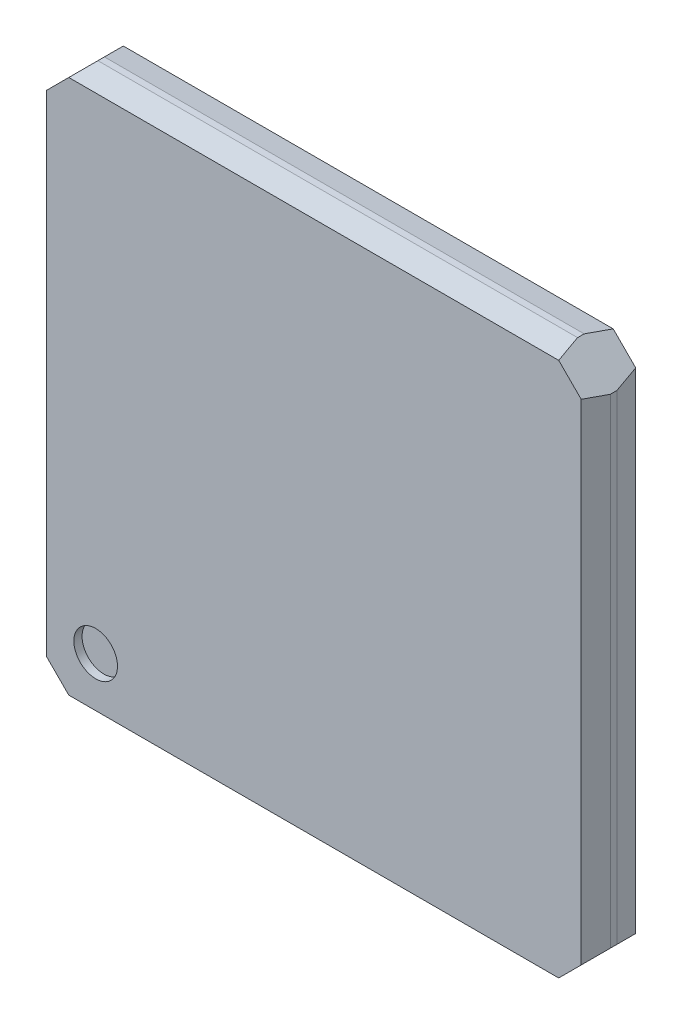
ISO-10303-21;
HEADER;
FILE_DESCRIPTION(('STEP AP214'),'2;1');
FILE_NAME('part.step','',(''),(''),'','','');
FILE_SCHEMA(('AUTOMOTIVE_DESIGN { 1 0 10303 214 1 1 1 1 }'));
ENDSEC;
DATA;
#1=APPLICATION_CONTEXT('core data for automotive mechanical design processes');
#2=APPLICATION_PROTOCOL_DEFINITION('international standard','automotive_design',2000,#1);
#3=PRODUCT_CONTEXT('',#1,'mechanical');
#4=PRODUCT('Part','Part','',(#3));
#5=PRODUCT_RELATED_PRODUCT_CATEGORY('part','',(#4));
#6=PRODUCT_DEFINITION_FORMATION('','',#4);
#7=PRODUCT_DEFINITION_CONTEXT('part definition',#1,'design');
#8=PRODUCT_DEFINITION('design','',#6,#7);
#9=PRODUCT_DEFINITION_SHAPE('','',#8);
#10=(LENGTH_UNIT() NAMED_UNIT(*) SI_UNIT(.MILLI.,.METRE.));
#11=(NAMED_UNIT(*) PLANE_ANGLE_UNIT() SI_UNIT($,.RADIAN.));
#12=(NAMED_UNIT(*) SI_UNIT($,.STERADIAN.) SOLID_ANGLE_UNIT());
#13=UNCERTAINTY_MEASURE_WITH_UNIT(LENGTH_MEASURE(1.E-05),#10,'distance_accuracy_value','');
#14=(GEOMETRIC_REPRESENTATION_CONTEXT(3) GLOBAL_UNCERTAINTY_ASSIGNED_CONTEXT((#13)) GLOBAL_UNIT_ASSIGNED_CONTEXT((#10,
#11,#12)) REPRESENTATION_CONTEXT('',''));
#15=CARTESIAN_POINT('',(0.,0.,0.));
#16=DIRECTION('',(0.,0.,1.));
#17=DIRECTION('',(1.,0.,0.));
#18=AXIS2_PLACEMENT_3D('',#15,#16,#17);
#19=CARTESIAN_POINT('',(-4.,-4.,0.85));
#20=DIRECTION('',(0.,0.,1.));
#21=DIRECTION('',(1.,0.,0.));
#22=AXIS2_PLACEMENT_3D('',#19,#20,#21);
#23=PLANE('',#22);
#24=CARTESIAN_POINT('',(-4.,-4.,0.85));
#25=DIRECTION('',(0.,0.,1.));
#26=DIRECTION('',(1.,0.,0.));
#27=AXIS2_PLACEMENT_3D('',#24,#25,#26);
#28=CIRCLE('',#27,0.4);
#29=CARTESIAN_POINT('',(-3.6,-4.,0.85));
#30=VERTEX_POINT('',#29);
#31=EDGE_CURVE('E19',#30,#30,#28,.T.);
#32=ORIENTED_EDGE('',*,*,#31,.T.);
#33=EDGE_LOOP('',(#32));
#34=FACE_BOUND('',#33,.T.);
#35=ADVANCED_FACE('F16',(#34),#23,.T.);
#36=CARTESIAN_POINT('',(-4.,-4.,0.85));
#37=DIRECTION('',(0.,0.,1.));
#38=DIRECTION('',(1.,0.,0.));
#39=AXIS2_PLACEMENT_3D('',#36,#37,#38);
#40=CYLINDRICAL_SURFACE('',#39,0.4);
#41=ORIENTED_EDGE('',*,*,#31,.F.);
#42=EDGE_LOOP('',(#41));
#43=FACE_BOUND('',#42,.T.);
#44=CARTESIAN_POINT('',(-4.,-4.,1.));
#45=DIRECTION('',(0.,0.,1.));
#46=DIRECTION('',(1.,0.,0.));
#47=AXIS2_PLACEMENT_3D('',#44,#45,#46);
#48=CIRCLE('',#47,0.4);
#49=CARTESIAN_POINT('',(-3.6,-4.,1.));
#50=VERTEX_POINT('',#49);
#51=EDGE_CURVE('E155',#50,#50,#48,.T.);
#52=ORIENTED_EDGE('',*,*,#51,.T.);
#53=EDGE_LOOP('',(#52));
#54=FACE_BOUND('',#53,.T.);
#55=ADVANCED_FACE('F458',(#43,#54),#40,.F.);
#56=CARTESIAN_POINT('',(-24.28355697996,0.,1.));
#57=DIRECTION('',(0.,0.,-1.));
#58=DIRECTION('',(-1.,0.,0.));
#59=AXIS2_PLACEMENT_3D('',#56,#57,#58);
#60=PLANE('',#59);
#61=ORIENTED_EDGE('',*,*,#51,.F.);
#62=EDGE_LOOP('',(#61));
#63=FACE_BOUND('',#62,.T.);
#64=DIRECTION('',(0.70710678118655,-0.707106781186545,0.));
#65=VECTOR('',#64,1.);
#66=CARTESIAN_POINT('',(4.493524887135,4.906475112865,1.));
#67=LINE('',#66,#65);
#68=CARTESIAN_POINT('',(4.493524887135,4.90647511286503,1.00000000000001));
#69=VERTEX_POINT('',#68);
#70=CARTESIAN_POINT('',(4.90647511286503,4.493524887135,1.00000000000001));
#71=VERTEX_POINT('',#70);
#72=EDGE_CURVE('E159',#69,#71,#67,.T.);
#73=ORIENTED_EDGE('',*,*,#72,.F.);
#74=DIRECTION('',(1.,0.,0.));
#75=VECTOR('',#74,1.);
#76=CARTESIAN_POINT('',(-5.,4.9064751128651,1.00000000000002));
#77=LINE('',#76,#75);
#78=CARTESIAN_POINT('',(-4.493524887135,4.90647511286502,1.00000000000001));
#79=VERTEX_POINT('',#78);
#80=EDGE_CURVE('E186',#69,#79,#77,.F.);
#81=ORIENTED_EDGE('',*,*,#80,.T.);
#82=DIRECTION('',(0.70710678118655,0.707106781186545,0.));
#83=VECTOR('',#82,1.);
#84=CARTESIAN_POINT('',(-4.906475112865,4.493524887135,1.));
#85=LINE('',#84,#83);
#86=CARTESIAN_POINT('',(-4.90647511286503,4.493524887135,1.00000000000001));
#87=VERTEX_POINT('',#86);
#88=EDGE_CURVE('E162',#87,#79,#85,.T.);
#89=ORIENTED_EDGE('',*,*,#88,.F.);
#90=DIRECTION('',(0.,1.,0.));
#91=VECTOR('',#90,1.);
#92=CARTESIAN_POINT('',(-4.9064751128651,5.,1.00000000000002));
#93=LINE('',#92,#91);
#94=CARTESIAN_POINT('',(-4.90647511286503,-4.493524887135,1.00000000000001));
#95=VERTEX_POINT('',#94);
#96=EDGE_CURVE('E169',#87,#95,#93,.F.);
#97=ORIENTED_EDGE('',*,*,#96,.T.);
#98=DIRECTION('',(-0.70710678118655,0.707106781186545,0.));
#99=VECTOR('',#98,1.);
#100=CARTESIAN_POINT('',(-4.493524887135,-4.906475112865,1.));
#101=LINE('',#100,#99);
#102=CARTESIAN_POINT('',(-4.493524887135,-4.90647511286502,1.00000000000001));
#103=VERTEX_POINT('',#102);
#104=EDGE_CURVE('E141',#103,#95,#101,.T.);
#105=ORIENTED_EDGE('',*,*,#104,.F.);
#106=DIRECTION('',(1.,0.,0.));
#107=VECTOR('',#106,1.);
#108=CARTESIAN_POINT('',(-5.,-4.9064751128651,1.00000000000002));
#109=LINE('',#108,#107);
#110=CARTESIAN_POINT('',(4.493524887135,-4.90647511286502,1.00000000000001));
#111=VERTEX_POINT('',#110);
#112=EDGE_CURVE('E144',#103,#111,#109,.T.);
#113=ORIENTED_EDGE('',*,*,#112,.T.);
#114=DIRECTION('',(-0.70710678118655,-0.707106781186545,0.));
#115=VECTOR('',#114,1.);
#116=CARTESIAN_POINT('',(4.906475112865,-4.493524887135,1.));
#117=LINE('',#116,#115);
#118=CARTESIAN_POINT('',(4.90647511286503,-4.493524887135,1.00000000000001));
#119=VERTEX_POINT('',#118);
#120=EDGE_CURVE('E130',#119,#111,#117,.T.);
#121=ORIENTED_EDGE('',*,*,#120,.F.);
#122=DIRECTION('',(0.,1.,0.));
#123=VECTOR('',#122,1.);
#124=CARTESIAN_POINT('',(4.9064751128651,5.,1.00000000000002));
#125=LINE('',#124,#123);
#126=EDGE_CURVE('E191',#119,#71,#125,.T.);
#127=ORIENTED_EDGE('',*,*,#126,.T.);
#128=EDGE_LOOP('',(#73,#81,#89,#97,#105,#113,#121,#127));
#129=FACE_BOUND('',#128,.T.);
#130=ADVANCED_FACE('F146',(#63,#129),#60,.F.);
#131=CARTESIAN_POINT('',(-5.,-5.,0.56));
#132=DIRECTION('',(0.,0.978147600733765,-0.20791169081795));
#133=DIRECTION('',(0.,0.20791169081795,0.978147600733765));
#134=AXIS2_PLACEMENT_3D('',#131,#132,#133);
#135=PLANE('',#134);
#136=DIRECTION('',(-0.203558594953159,0.20355859495295,0.957667894857855));
#137=VECTOR('',#136,1.);
#138=CARTESIAN_POINT('',(-4.4,-5.,0.56));
#139=LINE('',#138,#137);
#140=CARTESIAN_POINT('',(-4.4,-5.,0.560000000000003));
#141=VERTEX_POINT('',#140);
#142=EDGE_CURVE('E125',#141,#103,#139,.T.);
#143=ORIENTED_EDGE('',*,*,#142,.F.);
#144=DIRECTION('',(1.,0.,0.));
#145=VECTOR('',#144,1.);
#146=CARTESIAN_POINT('',(-5.,-5.,0.56));
#147=LINE('',#146,#145);
#148=CARTESIAN_POINT('',(4.4,-5.,0.56));
#149=VERTEX_POINT('',#148);
#150=EDGE_CURVE('E153',#141,#149,#147,.T.);
#151=ORIENTED_EDGE('',*,*,#150,.T.);
#152=DIRECTION('',(-0.203558594953159,-0.20355859495295,-0.957667894857855));
#153=VECTOR('',#152,1.);
#154=CARTESIAN_POINT('',(4.493524887135,-4.9064751128651,1.00000000000002));
#155=LINE('',#154,#153);
#156=EDGE_CURVE('E134',#111,#149,#155,.T.);
#157=ORIENTED_EDGE('',*,*,#156,.F.);
#158=ORIENTED_EDGE('',*,*,#112,.F.);
#159=EDGE_LOOP('',(#143,#151,#157,#158));
#160=FACE_BOUND('',#159,.T.);
#161=ADVANCED_FACE('F151',(#160),#135,.F.);
#162=CARTESIAN_POINT('',(-5.,5.,0.56));
#163=DIRECTION('',(0.978147600733765,0.,-0.20791169081795));
#164=DIRECTION('',(-0.20791169081795,0.,-0.978147600733765));
#165=AXIS2_PLACEMENT_3D('',#162,#163,#164);
#166=PLANE('',#165);
#167=DIRECTION('',(0.20355859495295,0.203558594953159,0.957667894857855));
#168=VECTOR('',#167,1.);
#169=CARTESIAN_POINT('',(-5.,4.4,0.56));
#170=LINE('',#169,#168);
#171=CARTESIAN_POINT('',(-5.,4.4,0.560000000000003));
#172=VERTEX_POINT('',#171);
#173=EDGE_CURVE('E174',#172,#87,#170,.T.);
#174=ORIENTED_EDGE('',*,*,#173,.F.);
#175=DIRECTION('',(0.,1.,0.));
#176=VECTOR('',#175,1.);
#177=CARTESIAN_POINT('',(-5.,5.,0.56));
#178=LINE('',#177,#176);
#179=CARTESIAN_POINT('',(-5.,-4.4,0.56));
#180=VERTEX_POINT('',#179);
#181=EDGE_CURVE('E178',#172,#180,#178,.F.);
#182=ORIENTED_EDGE('',*,*,#181,.T.);
#183=DIRECTION('',(-0.20355859495295,0.203558594953159,-0.957667894857855));
#184=VECTOR('',#183,1.);
#185=CARTESIAN_POINT('',(-4.9064751128651,-4.493524887135,1.00000000000002));
#186=LINE('',#185,#184);
#187=EDGE_CURVE('E149',#95,#180,#186,.T.);
#188=ORIENTED_EDGE('',*,*,#187,.F.);
#189=ORIENTED_EDGE('',*,*,#96,.F.);
#190=EDGE_LOOP('',(#174,#182,#188,#189));
#191=FACE_BOUND('',#190,.T.);
#192=ADVANCED_FACE('F176',(#191),#166,.F.);
#193=CARTESIAN_POINT('',(-5.,5.,0.56));
#194=DIRECTION('',(0.,-0.978147600733765,-0.20791169081795));
#195=DIRECTION('',(0.,0.20791169081795,-0.978147600733765));
#196=AXIS2_PLACEMENT_3D('',#193,#194,#195);
#197=PLANE('',#196);
#198=DIRECTION('',(0.203558594953159,-0.20355859495295,0.957667894857855));
#199=VECTOR('',#198,1.);
#200=CARTESIAN_POINT('',(4.4,5.,0.56));
#201=LINE('',#200,#199);
#202=CARTESIAN_POINT('',(4.4,5.,0.560000000000003));
#203=VERTEX_POINT('',#202);
#204=EDGE_CURVE('E184',#203,#69,#201,.T.);
#205=ORIENTED_EDGE('',*,*,#204,.F.);
#206=DIRECTION('',(1.,0.,0.));
#207=VECTOR('',#206,1.);
#208=CARTESIAN_POINT('',(-5.,5.,0.56));
#209=LINE('',#208,#207);
#210=CARTESIAN_POINT('',(-4.4,5.,0.56));
#211=VERTEX_POINT('',#210);
#212=EDGE_CURVE('E201',#203,#211,#209,.F.);
#213=ORIENTED_EDGE('',*,*,#212,.T.);
#214=DIRECTION('',(0.203558594953159,0.20355859495295,-0.957667894857855));
#215=VECTOR('',#214,1.);
#216=CARTESIAN_POINT('',(-4.493524887135,4.9064751128651,1.00000000000002));
#217=LINE('',#216,#215);
#218=EDGE_CURVE('E173',#79,#211,#217,.T.);
#219=ORIENTED_EDGE('',*,*,#218,.F.);
#220=ORIENTED_EDGE('',*,*,#80,.F.);
#221=EDGE_LOOP('',(#205,#213,#219,#220));
#222=FACE_BOUND('',#221,.T.);
#223=ADVANCED_FACE('F283',(#222),#197,.F.);
#224=CARTESIAN_POINT('',(5.,5.,0.56));
#225=DIRECTION('',(-0.978147600733765,0.,-0.20791169081795));
#226=DIRECTION('',(-0.20791169081795,0.,0.978147600733765));
#227=AXIS2_PLACEMENT_3D('',#224,#225,#226);
#228=PLANE('',#227);
#229=DIRECTION('',(-0.20355859495295,-0.203558594953159,0.957667894857855));
#230=VECTOR('',#229,1.);
#231=CARTESIAN_POINT('',(5.,-4.4,0.56));
#232=LINE('',#231,#230);
#233=CARTESIAN_POINT('',(5.,-4.4,0.56));
#234=VERTEX_POINT('',#233);
#235=EDGE_CURVE('E137',#234,#119,#232,.T.);
#236=ORIENTED_EDGE('',*,*,#235,.F.);
#237=DIRECTION('',(0.,1.,0.));
#238=VECTOR('',#237,1.);
#239=CARTESIAN_POINT('',(5.,5.,0.56));
#240=LINE('',#239,#238);
#241=CARTESIAN_POINT('',(5.,4.4,0.56));
#242=VERTEX_POINT('',#241);
#243=EDGE_CURVE('E204',#234,#242,#240,.T.);
#244=ORIENTED_EDGE('',*,*,#243,.T.);
#245=DIRECTION('',(0.20355859495295,-0.203558594953159,-0.957667894857855));
#246=VECTOR('',#245,1.);
#247=CARTESIAN_POINT('',(4.9064751128651,4.493524887135,1.00000000000002));
#248=LINE('',#247,#246);
#249=EDGE_CURVE('E188',#71,#242,#248,.T.);
#250=ORIENTED_EDGE('',*,*,#249,.F.);
#251=ORIENTED_EDGE('',*,*,#126,.F.);
#252=EDGE_LOOP('',(#236,#244,#250,#251));
#253=FACE_BOUND('',#252,.T.);
#254=ADVANCED_FACE('F287',(#253),#228,.F.);
#255=CARTESIAN_POINT('',(-5.,-5.,0.));
#256=DIRECTION('',(0.,1.,0.));
#257=DIRECTION('',(0.,0.,1.));
#258=AXIS2_PLACEMENT_3D('',#255,#256,#257);
#259=PLANE('',#258);
#260=DIRECTION('',(0.,0.,1.));
#261=VECTOR('',#260,1.);
#262=CARTESIAN_POINT('',(-4.4,-5.,0.));
#263=LINE('',#262,#261);
#264=CARTESIAN_POINT('',(-4.4,-4.99999999999998,0.440000000000005));
#265=VERTEX_POINT('',#264);
#266=EDGE_CURVE('E193',#265,#141,#263,.T.);
#267=ORIENTED_EDGE('',*,*,#266,.F.);
#268=DIRECTION('',(1.,0.,0.));
#269=VECTOR('',#268,1.);
#270=CARTESIAN_POINT('',(-24.28355697996,-4.9999999999999,0.44000000000002));
#271=LINE('',#270,#269);
#272=CARTESIAN_POINT('',(4.4,-4.99999999999998,0.440000000000005));
#273=VERTEX_POINT('',#272);
#274=EDGE_CURVE('E214',#273,#265,#271,.F.);
#275=ORIENTED_EDGE('',*,*,#274,.F.);
#276=DIRECTION('',(0.,0.,1.));
#277=VECTOR('',#276,1.);
#278=CARTESIAN_POINT('',(4.4,-5.,0.));
#279=LINE('',#278,#277);
#280=EDGE_CURVE('E209',#273,#149,#279,.T.);
#281=ORIENTED_EDGE('',*,*,#280,.T.);
#282=ORIENTED_EDGE('',*,*,#150,.F.);
#283=EDGE_LOOP('',(#267,#275,#281,#282));
#284=FACE_BOUND('',#283,.T.);
#285=ADVANCED_FACE('F312',(#284),#259,.F.);
#286=CARTESIAN_POINT('',(-5.,5.,0.));
#287=DIRECTION('',(1.,0.,0.));
#288=DIRECTION('',(0.,0.,-1.));
#289=AXIS2_PLACEMENT_3D('',#286,#287,#288);
#290=PLANE('',#289);
#291=DIRECTION('',(0.,0.,-1.));
#292=VECTOR('',#291,1.);
#293=CARTESIAN_POINT('',(-5.,4.4,0.));
#294=LINE('',#293,#292);
#295=CARTESIAN_POINT('',(-4.99999999999998,4.4,0.440000000000005));
#296=VERTEX_POINT('',#295);
#297=EDGE_CURVE('E196',#296,#172,#294,.F.);
#298=ORIENTED_EDGE('',*,*,#297,.F.);
#299=DIRECTION('',(0.,1.,0.));
#300=VECTOR('',#299,1.);
#301=CARTESIAN_POINT('',(-4.9999999999999,0.,0.44000000000002));
#302=LINE('',#301,#300);
#303=CARTESIAN_POINT('',(-4.99999999999998,-4.4,0.440000000000005));
#304=VERTEX_POINT('',#303);
#305=EDGE_CURVE('E224',#304,#296,#302,.T.);
#306=ORIENTED_EDGE('',*,*,#305,.F.);
#307=DIRECTION('',(0.,0.,1.));
#308=VECTOR('',#307,1.);
#309=CARTESIAN_POINT('',(-5.,-4.4,0.));
#310=LINE('',#309,#308);
#311=EDGE_CURVE('E219',#304,#180,#310,.T.);
#312=ORIENTED_EDGE('',*,*,#311,.T.);
#313=ORIENTED_EDGE('',*,*,#181,.F.);
#314=EDGE_LOOP('',(#298,#306,#312,#313));
#315=FACE_BOUND('',#314,.T.);
#316=ADVANCED_FACE('F310',(#315),#290,.F.);
#317=CARTESIAN_POINT('',(-5.,5.,0.));
#318=DIRECTION('',(0.,-1.,0.));
#319=DIRECTION('',(0.,0.,-1.));
#320=AXIS2_PLACEMENT_3D('',#317,#318,#319);
#321=PLANE('',#320);
#322=DIRECTION('',(0.,0.,-1.));
#323=VECTOR('',#322,1.);
#324=CARTESIAN_POINT('',(4.4,5.,0.));
#325=LINE('',#324,#323);
#326=CARTESIAN_POINT('',(4.4,4.99999999999998,0.440000000000005));
#327=VERTEX_POINT('',#326);
#328=EDGE_CURVE('E199',#327,#203,#325,.F.);
#329=ORIENTED_EDGE('',*,*,#328,.F.);
#330=DIRECTION('',(1.,0.,0.));
#331=VECTOR('',#330,1.);
#332=CARTESIAN_POINT('',(-24.28355697996,4.9999999999999,0.44000000000002));
#333=LINE('',#332,#331);
#334=CARTESIAN_POINT('',(-4.4,4.99999999999998,0.440000000000005));
#335=VERTEX_POINT('',#334);
#336=EDGE_CURVE('E235',#335,#327,#333,.T.);
#337=ORIENTED_EDGE('',*,*,#336,.F.);
#338=DIRECTION('',(0.,0.,1.));
#339=VECTOR('',#338,1.);
#340=CARTESIAN_POINT('',(-4.4,5.,0.));
#341=LINE('',#340,#339);
#342=EDGE_CURVE('E229',#335,#211,#341,.T.);
#343=ORIENTED_EDGE('',*,*,#342,.T.);
#344=ORIENTED_EDGE('',*,*,#212,.F.);
#345=EDGE_LOOP('',(#329,#337,#343,#344));
#346=FACE_BOUND('',#345,.T.);
#347=ADVANCED_FACE('F279',(#346),#321,.F.);
#348=CARTESIAN_POINT('',(5.,5.,0.));
#349=DIRECTION('',(-1.,0.,0.));
#350=DIRECTION('',(0.,0.,1.));
#351=AXIS2_PLACEMENT_3D('',#348,#349,#350);
#352=PLANE('',#351);
#353=DIRECTION('',(0.,0.,1.));
#354=VECTOR('',#353,1.);
#355=CARTESIAN_POINT('',(5.,-4.4,0.));
#356=LINE('',#355,#354);
#357=CARTESIAN_POINT('',(4.99999999999998,-4.4,0.440000000000005));
#358=VERTEX_POINT('',#357);
#359=EDGE_CURVE('E207',#234,#358,#356,.F.);
#360=ORIENTED_EDGE('',*,*,#359,.T.);
#361=DIRECTION('',(0.,1.,0.));
#362=VECTOR('',#361,1.);
#363=CARTESIAN_POINT('',(4.9999999999999,0.,0.44000000000002));
#364=LINE('',#363,#362);
#365=CARTESIAN_POINT('',(4.99999999999998,4.4,0.440000000000005));
#366=VERTEX_POINT('',#365);
#367=EDGE_CURVE('E247',#366,#358,#364,.F.);
#368=ORIENTED_EDGE('',*,*,#367,.F.);
#369=DIRECTION('',(0.,0.,1.));
#370=VECTOR('',#369,1.);
#371=CARTESIAN_POINT('',(5.,4.4,0.));
#372=LINE('',#371,#370);
#373=EDGE_CURVE('E240',#366,#242,#372,.T.);
#374=ORIENTED_EDGE('',*,*,#373,.T.);
#375=ORIENTED_EDGE('',*,*,#243,.F.);
#376=EDGE_LOOP('',(#360,#368,#374,#375));
#377=FACE_BOUND('',#376,.T.);
#378=ADVANCED_FACE('F291',(#377),#352,.F.);
#379=CARTESIAN_POINT('',(4.4,-5.,0.));
#380=DIRECTION('',(-0.707106781186548,0.707106781186548,0.));
#381=DIRECTION('',(-0.707106781186548,-0.707106781186548,0.));
#382=AXIS2_PLACEMENT_3D('',#379,#380,#381);
#383=PLANE('',#382);
#384=ORIENTED_EDGE('',*,*,#120,.T.);
#385=ORIENTED_EDGE('',*,*,#156,.T.);
#386=ORIENTED_EDGE('',*,*,#280,.F.);
#387=DIRECTION('',(-0.203558594953156,-0.20355859495295,0.957667894857856));
#388=VECTOR('',#387,1.);
#389=CARTESIAN_POINT('',(4.493524887135,-4.906475112865,0.));
#390=LINE('',#389,#388);
#391=CARTESIAN_POINT('',(4.493524887135,-4.906475112865,0.));
#392=VERTEX_POINT('',#391);
#393=EDGE_CURVE('E211',#392,#273,#390,.T.);
#394=ORIENTED_EDGE('',*,*,#393,.F.);
#395=DIRECTION('',(-0.70710678118655,-0.707106781186545,0.));
#396=VECTOR('',#395,1.);
#397=CARTESIAN_POINT('',(4.906475112865,-4.493524887135,0.));
#398=LINE('',#397,#396);
#399=CARTESIAN_POINT('',(4.906475112865,-4.493524887135,0.));
#400=VERTEX_POINT('',#399);
#401=EDGE_CURVE('E250',#400,#392,#398,.T.);
#402=ORIENTED_EDGE('',*,*,#401,.F.);
#403=DIRECTION('',(-0.20355859495295,-0.203558594953159,-0.957667894857856));
#404=VECTOR('',#403,1.);
#405=CARTESIAN_POINT('',(4.9999999999999,-4.4,0.44000000000002));
#406=LINE('',#405,#404);
#407=EDGE_CURVE('E243',#358,#400,#406,.T.);
#408=ORIENTED_EDGE('',*,*,#407,.F.);
#409=ORIENTED_EDGE('',*,*,#359,.F.);
#410=ORIENTED_EDGE('',*,*,#235,.T.);
#411=EDGE_LOOP('',(#384,#385,#386,#394,#402,#408,#409,#410));
#412=FACE_BOUND('',#411,.T.);
#413=ADVANCED_FACE('F132',(#412),#383,.F.);
#414=CARTESIAN_POINT('',(-24.28355697996,-4.906475112865,0.));
#415=DIRECTION('',(0.,-0.978147600733765,-0.20791169081795));
#416=DIRECTION('',(0.,0.20791169081795,-0.978147600733765));
#417=AXIS2_PLACEMENT_3D('',#414,#415,#416);
#418=PLANE('',#417);
#419=ORIENTED_EDGE('',*,*,#393,.T.);
#420=ORIENTED_EDGE('',*,*,#274,.T.);
#421=DIRECTION('',(-0.203558594953157,0.203558594953157,-0.957667894857812));
#422=VECTOR('',#421,1.);
#423=CARTESIAN_POINT('',(-4.4,-5.,0.44));
#424=LINE('',#423,#422);
#425=CARTESIAN_POINT('',(-4.493524887135,-4.906475112865,0.));
#426=VERTEX_POINT('',#425);
#427=EDGE_CURVE('E217',#265,#426,#424,.T.);
#428=ORIENTED_EDGE('',*,*,#427,.T.);
#429=DIRECTION('',(-1.,0.,0.));
#430=VECTOR('',#429,1.);
#431=CARTESIAN_POINT('',(-24.28355697996,-4.906475112865,0.));
#432=LINE('',#431,#430);
#433=EDGE_CURVE('E253',#392,#426,#432,.T.);
#434=ORIENTED_EDGE('',*,*,#433,.F.);
#435=EDGE_LOOP('',(#419,#420,#428,#434));
#436=FACE_BOUND('',#435,.T.);
#437=ADVANCED_FACE('F298',(#436),#418,.T.);
#438=CARTESIAN_POINT('',(-5.,-4.4,0.));
#439=DIRECTION('',(0.707106781186548,0.707106781186548,0.));
#440=DIRECTION('',(-0.707106781186548,0.707106781186548,0.));
#441=AXIS2_PLACEMENT_3D('',#438,#439,#440);
#442=PLANE('',#441);
#443=ORIENTED_EDGE('',*,*,#311,.F.);
#444=DIRECTION('',(-0.20355859495295,0.203558594953159,0.957667894857856));
#445=VECTOR('',#444,1.);
#446=CARTESIAN_POINT('',(-4.906475112865,-4.493524887135,0.));
#447=LINE('',#446,#445);
#448=CARTESIAN_POINT('',(-4.906475112865,-4.493524887135,0.));
#449=VERTEX_POINT('',#448);
#450=EDGE_CURVE('E221',#449,#304,#447,.T.);
#451=ORIENTED_EDGE('',*,*,#450,.F.);
#452=DIRECTION('',(-0.70710678118655,0.707106781186545,0.));
#453=VECTOR('',#452,1.);
#454=CARTESIAN_POINT('',(-4.493524887135,-4.906475112865,0.));
#455=LINE('',#454,#453);
#456=EDGE_CURVE('E256',#426,#449,#455,.T.);
#457=ORIENTED_EDGE('',*,*,#456,.F.);
#458=ORIENTED_EDGE('',*,*,#427,.F.);
#459=ORIENTED_EDGE('',*,*,#266,.T.);
#460=ORIENTED_EDGE('',*,*,#142,.T.);
#461=ORIENTED_EDGE('',*,*,#104,.T.);
#462=ORIENTED_EDGE('',*,*,#187,.T.);
#463=EDGE_LOOP('',(#443,#451,#457,#458,#459,#460,#461,#462));
#464=FACE_BOUND('',#463,.T.);
#465=ADVANCED_FACE('F164',(#464),#442,.F.);
#466=CARTESIAN_POINT('',(-4.906475112865,0.,0.));
#467=DIRECTION('',(-0.978147600733765,0.,-0.20791169081795));
#468=DIRECTION('',(-0.20791169081795,0.,0.978147600733765));
#469=AXIS2_PLACEMENT_3D('',#466,#467,#468);
#470=PLANE('',#469);
#471=ORIENTED_EDGE('',*,*,#450,.T.);
#472=ORIENTED_EDGE('',*,*,#305,.T.);
#473=DIRECTION('',(0.203558594953158,0.203558594953158,-0.957667894857812));
#474=VECTOR('',#473,1.);
#475=CARTESIAN_POINT('',(-5.,4.4,0.44));
#476=LINE('',#475,#474);
#477=CARTESIAN_POINT('',(-4.906475112865,4.493524887135,0.));
#478=VERTEX_POINT('',#477);
#479=EDGE_CURVE('E227',#296,#478,#476,.T.);
#480=ORIENTED_EDGE('',*,*,#479,.T.);
#481=DIRECTION('',(0.,1.,0.));
#482=VECTOR('',#481,1.);
#483=CARTESIAN_POINT('',(-4.906475112865,0.,0.));
#484=LINE('',#483,#482);
#485=EDGE_CURVE('E259',#449,#478,#484,.T.);
#486=ORIENTED_EDGE('',*,*,#485,.F.);
#487=EDGE_LOOP('',(#471,#472,#480,#486));
#488=FACE_BOUND('',#487,.T.);
#489=ADVANCED_FACE('F304',(#488),#470,.T.);
#490=CARTESIAN_POINT('',(-4.4,5.,0.));
#491=DIRECTION('',(0.707106781186548,-0.707106781186548,0.));
#492=DIRECTION('',(0.707106781186548,0.707106781186548,0.));
#493=AXIS2_PLACEMENT_3D('',#490,#491,#492);
#494=PLANE('',#493);
#495=ORIENTED_EDGE('',*,*,#342,.F.);
#496=DIRECTION('',(0.203558594953156,0.20355859495295,0.957667894857856));
#497=VECTOR('',#496,1.);
#498=CARTESIAN_POINT('',(-4.493524887135,4.906475112865,0.));
#499=LINE('',#498,#497);
#500=CARTESIAN_POINT('',(-4.493524887135,4.906475112865,0.));
#501=VERTEX_POINT('',#500);
#502=EDGE_CURVE('E232',#501,#335,#499,.T.);
#503=ORIENTED_EDGE('',*,*,#502,.F.);
#504=DIRECTION('',(0.70710678118655,0.707106781186545,0.));
#505=VECTOR('',#504,1.);
#506=CARTESIAN_POINT('',(-4.906475112865,4.493524887135,0.));
#507=LINE('',#506,#505);
#508=EDGE_CURVE('E262',#478,#501,#507,.T.);
#509=ORIENTED_EDGE('',*,*,#508,.F.);
#510=ORIENTED_EDGE('',*,*,#479,.F.);
#511=ORIENTED_EDGE('',*,*,#297,.T.);
#512=ORIENTED_EDGE('',*,*,#173,.T.);
#513=ORIENTED_EDGE('',*,*,#88,.T.);
#514=ORIENTED_EDGE('',*,*,#218,.T.);
#515=EDGE_LOOP('',(#495,#503,#509,#510,#511,#512,#513,#514));
#516=FACE_BOUND('',#515,.T.);
#517=ADVANCED_FACE('F308',(#516),#494,.F.);
#518=CARTESIAN_POINT('',(-24.28355697996,4.906475112865,0.));
#519=DIRECTION('',(0.,0.978147600733765,-0.20791169081795));
#520=DIRECTION('',(0.,0.20791169081795,0.978147600733765));
#521=AXIS2_PLACEMENT_3D('',#518,#519,#520);
#522=PLANE('',#521);
#523=ORIENTED_EDGE('',*,*,#502,.T.);
#524=ORIENTED_EDGE('',*,*,#336,.T.);
#525=DIRECTION('',(0.203558594953157,-0.203558594953157,-0.957667894857812));
#526=VECTOR('',#525,1.);
#527=CARTESIAN_POINT('',(4.4,5.,0.44));
#528=LINE('',#527,#526);
#529=CARTESIAN_POINT('',(4.493524887135,4.906475112865,0.));
#530=VERTEX_POINT('',#529);
#531=EDGE_CURVE('E238',#327,#530,#528,.T.);
#532=ORIENTED_EDGE('',*,*,#531,.T.);
#533=DIRECTION('',(-1.,0.,0.));
#534=VECTOR('',#533,1.);
#535=CARTESIAN_POINT('',(-24.28355697996,4.906475112865,0.));
#536=LINE('',#535,#534);
#537=EDGE_CURVE('E265',#501,#530,#536,.F.);
#538=ORIENTED_EDGE('',*,*,#537,.F.);
#539=EDGE_LOOP('',(#523,#524,#532,#538));
#540=FACE_BOUND('',#539,.T.);
#541=ADVANCED_FACE('F276',(#540),#522,.T.);
#542=CARTESIAN_POINT('',(5.,4.4,0.));
#543=DIRECTION('',(-0.707106781186548,-0.707106781186548,0.));
#544=DIRECTION('',(0.707106781186548,-0.707106781186548,0.));
#545=AXIS2_PLACEMENT_3D('',#542,#543,#544);
#546=PLANE('',#545);
#547=ORIENTED_EDGE('',*,*,#373,.F.);
#548=DIRECTION('',(0.20355859495295,-0.203558594953159,0.957667894857856));
#549=VECTOR('',#548,1.);
#550=CARTESIAN_POINT('',(4.906475112865,4.493524887135,0.));
#551=LINE('',#550,#549);
#552=CARTESIAN_POINT('',(4.906475112865,4.493524887135,0.));
#553=VERTEX_POINT('',#552);
#554=EDGE_CURVE('E34',#553,#366,#551,.T.);
#555=ORIENTED_EDGE('',*,*,#554,.F.);
#556=DIRECTION('',(0.70710678118655,-0.707106781186545,0.));
#557=VECTOR('',#556,1.);
#558=CARTESIAN_POINT('',(4.493524887135,4.906475112865,0.));
#559=LINE('',#558,#557);
#560=EDGE_CURVE('E25',#530,#553,#559,.T.);
#561=ORIENTED_EDGE('',*,*,#560,.F.);
#562=ORIENTED_EDGE('',*,*,#531,.F.);
#563=ORIENTED_EDGE('',*,*,#328,.T.);
#564=ORIENTED_EDGE('',*,*,#204,.T.);
#565=ORIENTED_EDGE('',*,*,#72,.T.);
#566=ORIENTED_EDGE('',*,*,#249,.T.);
#567=EDGE_LOOP('',(#547,#555,#561,#562,#563,#564,#565,#566));
#568=FACE_BOUND('',#567,.T.);
#569=ADVANCED_FACE('F273',(#568),#546,.F.);
#570=CARTESIAN_POINT('',(4.906475112865,0.,0.));
#571=DIRECTION('',(0.978147600733765,0.,-0.20791169081795));
#572=DIRECTION('',(-0.20791169081795,0.,-0.978147600733765));
#573=AXIS2_PLACEMENT_3D('',#570,#571,#572);
#574=PLANE('',#573);
#575=ORIENTED_EDGE('',*,*,#554,.T.);
#576=ORIENTED_EDGE('',*,*,#367,.T.);
#577=ORIENTED_EDGE('',*,*,#407,.T.);
#578=DIRECTION('',(0.,1.,0.));
#579=VECTOR('',#578,1.);
#580=CARTESIAN_POINT('',(4.906475112865,0.,0.));
#581=LINE('',#580,#579);
#582=EDGE_CURVE('E10',#553,#400,#581,.F.);
#583=ORIENTED_EDGE('',*,*,#582,.F.);
#584=EDGE_LOOP('',(#575,#576,#577,#583));
#585=FACE_BOUND('',#584,.T.);
#586=ADVANCED_FACE('F294',(#585),#574,.T.);
#587=CARTESIAN_POINT('',(-24.28355697996,0.,0.));
#588=DIRECTION('',(0.,0.,-1.));
#589=DIRECTION('',(-1.,0.,0.));
#590=AXIS2_PLACEMENT_3D('',#587,#588,#589);
#591=PLANE('',#590);
#592=ORIENTED_EDGE('',*,*,#560,.T.);
#593=ORIENTED_EDGE('',*,*,#582,.T.);
#594=ORIENTED_EDGE('',*,*,#401,.T.);
#595=ORIENTED_EDGE('',*,*,#433,.T.);
#596=ORIENTED_EDGE('',*,*,#456,.T.);
#597=ORIENTED_EDGE('',*,*,#485,.T.);
#598=ORIENTED_EDGE('',*,*,#508,.T.);
#599=ORIENTED_EDGE('',*,*,#537,.T.);
#600=EDGE_LOOP('',(#592,#593,#594,#595,#596,#597,#598,#599));
#601=FACE_BOUND('',#600,.T.);
#602=ADVANCED_FACE('F270',(#601),#591,.T.);
#603=CLOSED_SHELL('',(#35,#55,#130,#161,#192,#223,#254,#285,#316,#347,#378,#413,#437,#465,#489,
#517,#541,#569,#586,#602));
#604=MANIFOLD_SOLID_BREP('B1',#603);
#605=ADVANCED_BREP_SHAPE_REPRESENTATION('',(#18,#604),#14);
#606=SHAPE_DEFINITION_REPRESENTATION(#9,#605);
ENDSEC;
END-ISO-10303-21;
